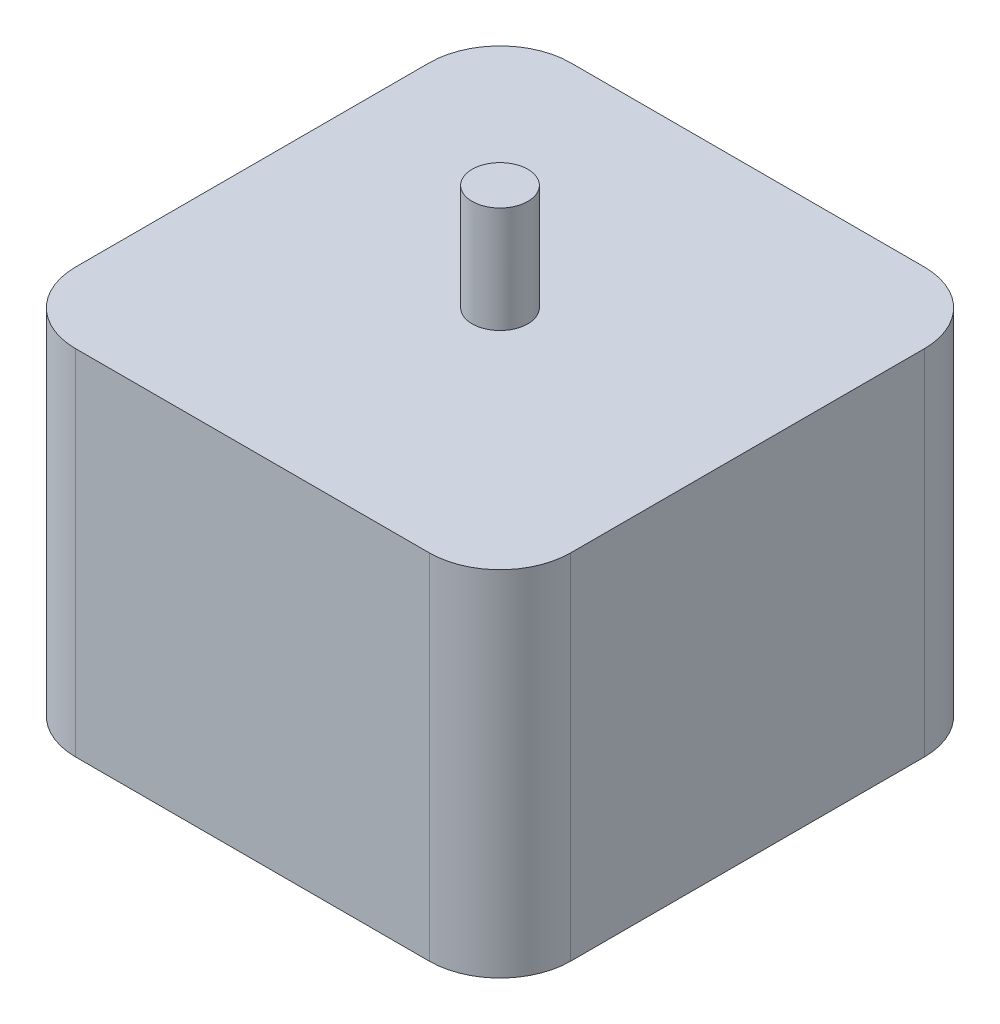
ISO-10303-21;
HEADER;
FILE_DESCRIPTION(('STEP AP214'),'2;1');
FILE_NAME('part.step','',(''),(''),'','','');
FILE_SCHEMA(('AUTOMOTIVE_DESIGN { 1 0 10303 214 1 1 1 1 }'));
ENDSEC;
DATA;
#1=APPLICATION_CONTEXT('core data for automotive mechanical design processes');
#2=APPLICATION_PROTOCOL_DEFINITION('international standard','automotive_design',2000,#1);
#3=PRODUCT_CONTEXT('',#1,'mechanical');
#4=PRODUCT('Part','Part','',(#3));
#5=PRODUCT_RELATED_PRODUCT_CATEGORY('part','',(#4));
#6=PRODUCT_DEFINITION_FORMATION('','',#4);
#7=PRODUCT_DEFINITION_CONTEXT('part definition',#1,'design');
#8=PRODUCT_DEFINITION('design','',#6,#7);
#9=PRODUCT_DEFINITION_SHAPE('','',#8);
#10=(LENGTH_UNIT() NAMED_UNIT(*) SI_UNIT(.MILLI.,.METRE.));
#11=(NAMED_UNIT(*) PLANE_ANGLE_UNIT() SI_UNIT($,.RADIAN.));
#12=(NAMED_UNIT(*) SI_UNIT($,.STERADIAN.) SOLID_ANGLE_UNIT());
#13=UNCERTAINTY_MEASURE_WITH_UNIT(LENGTH_MEASURE(1.E-05),#10,'distance_accuracy_value','');
#14=(GEOMETRIC_REPRESENTATION_CONTEXT(3) GLOBAL_UNCERTAINTY_ASSIGNED_CONTEXT((#13)) GLOBAL_UNIT_ASSIGNED_CONTEXT((#10,
#11,#12)) REPRESENTATION_CONTEXT('',''));
#15=CARTESIAN_POINT('',(0.,0.,0.));
#16=DIRECTION('',(0.,0.,1.));
#17=DIRECTION('',(1.,0.,0.));
#18=AXIS2_PLACEMENT_3D('',#15,#16,#17);
#19=CARTESIAN_POINT('',(22.225,31.75,22.225));
#20=DIRECTION('',(-1.,0.,0.));
#21=DIRECTION('',(0.,0.,1.));
#22=AXIS2_PLACEMENT_3D('',#19,#20,#21);
#23=PLANE('',#22);
#24=DIRECTION('',(0.,0.,-1.));
#25=VECTOR('',#24,1.);
#26=CARTESIAN_POINT('',(22.225,0.,22.225));
#27=LINE('',#26,#25);
#28=CARTESIAN_POINT('',(22.225,0.,15.875));
#29=VERTEX_POINT('',#28);
#30=CARTESIAN_POINT('',(22.225,0.,-15.875));
#31=VERTEX_POINT('',#30);
#32=EDGE_CURVE('E130',#29,#31,#27,.T.);
#33=ORIENTED_EDGE('',*,*,#32,.T.);
#34=DIRECTION('',(0.,-1.,0.));
#35=VECTOR('',#34,1.);
#36=CARTESIAN_POINT('',(22.225,31.75,-15.875));
#37=LINE('',#36,#35);
#38=CARTESIAN_POINT('',(22.225,31.75,-15.875));
#39=VERTEX_POINT('',#38);
#40=EDGE_CURVE('E41',#31,#39,#37,.F.);
#41=ORIENTED_EDGE('',*,*,#40,.T.);
#42=DIRECTION('',(0.,0.,-1.));
#43=VECTOR('',#42,1.);
#44=CARTESIAN_POINT('',(22.225,31.75,22.225));
#45=LINE('',#44,#43);
#46=CARTESIAN_POINT('',(22.225,31.75,15.875));
#47=VERTEX_POINT('',#46);
#48=EDGE_CURVE('E128',#47,#39,#45,.T.);
#49=ORIENTED_EDGE('',*,*,#48,.F.);
#50=DIRECTION('',(0.,-1.,0.));
#51=VECTOR('',#50,1.);
#52=CARTESIAN_POINT('',(22.225,31.75,15.875));
#53=LINE('',#52,#51);
#54=EDGE_CURVE('E154',#47,#29,#53,.T.);
#55=ORIENTED_EDGE('',*,*,#54,.T.);
#56=EDGE_LOOP('',(#33,#41,#49,#55));
#57=FACE_BOUND('',#56,.T.);
#58=ADVANCED_FACE('F33',(#57),#23,.F.);
#59=CARTESIAN_POINT('',(-22.225,31.75,-22.225));
#60=DIRECTION('',(0.,0.,1.));
#61=DIRECTION('',(1.,0.,0.));
#62=AXIS2_PLACEMENT_3D('',#59,#60,#61);
#63=PLANE('',#62);
#64=DIRECTION('',(-1.,0.,0.));
#65=VECTOR('',#64,1.);
#66=CARTESIAN_POINT('',(-22.225,0.,-22.225));
#67=LINE('',#66,#65);
#68=CARTESIAN_POINT('',(15.875,0.,-22.225));
#69=VERTEX_POINT('',#68);
#70=CARTESIAN_POINT('',(-15.875,0.,-22.225));
#71=VERTEX_POINT('',#70);
#72=EDGE_CURVE('E126',#69,#71,#67,.T.);
#73=ORIENTED_EDGE('',*,*,#72,.T.);
#74=DIRECTION('',(0.,-1.,0.));
#75=VECTOR('',#74,1.);
#76=CARTESIAN_POINT('',(-15.875,31.75,-22.225));
#77=LINE('',#76,#75);
#78=CARTESIAN_POINT('',(-15.875,31.75,-22.225));
#79=VERTEX_POINT('',#78);
#80=EDGE_CURVE('E105',#71,#79,#77,.F.);
#81=ORIENTED_EDGE('',*,*,#80,.T.);
#82=DIRECTION('',(-1.,0.,0.));
#83=VECTOR('',#82,1.);
#84=CARTESIAN_POINT('',(-22.225,31.75,-22.225));
#85=LINE('',#84,#83);
#86=CARTESIAN_POINT('',(15.875,31.75,-22.225));
#87=VERTEX_POINT('',#86);
#88=EDGE_CURVE('E169',#87,#79,#85,.T.);
#89=ORIENTED_EDGE('',*,*,#88,.F.);
#90=DIRECTION('',(0.,-1.,0.));
#91=VECTOR('',#90,1.);
#92=CARTESIAN_POINT('',(15.875,31.75,-22.225));
#93=LINE('',#92,#91);
#94=EDGE_CURVE('E110',#87,#69,#93,.T.);
#95=ORIENTED_EDGE('',*,*,#94,.T.);
#96=EDGE_LOOP('',(#73,#81,#89,#95));
#97=FACE_BOUND('',#96,.T.);
#98=ADVANCED_FACE('F174',(#97),#63,.F.);
#99=CARTESIAN_POINT('',(-22.225,31.75,22.225));
#100=DIRECTION('',(1.,0.,0.));
#101=DIRECTION('',(0.,0.,-1.));
#102=AXIS2_PLACEMENT_3D('',#99,#100,#101);
#103=PLANE('',#102);
#104=DIRECTION('',(0.,0.,1.));
#105=VECTOR('',#104,1.);
#106=CARTESIAN_POINT('',(-22.225,31.75,22.225));
#107=LINE('',#106,#105);
#108=CARTESIAN_POINT('',(-22.225,31.75,-15.875));
#109=VERTEX_POINT('',#108);
#110=CARTESIAN_POINT('',(-22.225,31.75,15.875));
#111=VERTEX_POINT('',#110);
#112=EDGE_CURVE('E119',#109,#111,#107,.T.);
#113=ORIENTED_EDGE('',*,*,#112,.F.);
#114=DIRECTION('',(0.,-1.,0.));
#115=VECTOR('',#114,1.);
#116=CARTESIAN_POINT('',(-22.225,31.75,-15.875));
#117=LINE('',#116,#115);
#118=CARTESIAN_POINT('',(-22.225,0.,-15.875));
#119=VERTEX_POINT('',#118);
#120=EDGE_CURVE('E104',#109,#119,#117,.T.);
#121=ORIENTED_EDGE('',*,*,#120,.T.);
#122=DIRECTION('',(0.,0.,1.));
#123=VECTOR('',#122,1.);
#124=CARTESIAN_POINT('',(-22.225,0.,22.225));
#125=LINE('',#124,#123);
#126=CARTESIAN_POINT('',(-22.225,0.,15.875));
#127=VERTEX_POINT('',#126);
#128=EDGE_CURVE('E117',#119,#127,#125,.T.);
#129=ORIENTED_EDGE('',*,*,#128,.T.);
#130=DIRECTION('',(0.,-1.,0.));
#131=VECTOR('',#130,1.);
#132=CARTESIAN_POINT('',(-22.225,31.75,15.875));
#133=LINE('',#132,#131);
#134=EDGE_CURVE('E121',#127,#111,#133,.F.);
#135=ORIENTED_EDGE('',*,*,#134,.T.);
#136=EDGE_LOOP('',(#113,#121,#129,#135));
#137=FACE_BOUND('',#136,.T.);
#138=ADVANCED_FACE('F116',(#137),#103,.F.);
#139=CARTESIAN_POINT('',(-22.225,31.75,22.225));
#140=DIRECTION('',(0.,0.,-1.));
#141=DIRECTION('',(-1.,0.,0.));
#142=AXIS2_PLACEMENT_3D('',#139,#140,#141);
#143=PLANE('',#142);
#144=DIRECTION('',(1.,0.,0.));
#145=VECTOR('',#144,1.);
#146=CARTESIAN_POINT('',(-22.225,31.75,22.225));
#147=LINE('',#146,#145);
#148=CARTESIAN_POINT('',(-15.875,31.75,22.225));
#149=VERTEX_POINT('',#148);
#150=CARTESIAN_POINT('',(15.875,31.75,22.225));
#151=VERTEX_POINT('',#150);
#152=EDGE_CURVE('E134',#149,#151,#147,.T.);
#153=ORIENTED_EDGE('',*,*,#152,.F.);
#154=DIRECTION('',(0.,-1.,0.));
#155=VECTOR('',#154,1.);
#156=CARTESIAN_POINT('',(-15.875,31.75,22.225));
#157=LINE('',#156,#155);
#158=CARTESIAN_POINT('',(-15.875,0.,22.225));
#159=VERTEX_POINT('',#158);
#160=EDGE_CURVE('E151',#149,#159,#157,.T.);
#161=ORIENTED_EDGE('',*,*,#160,.T.);
#162=DIRECTION('',(1.,0.,0.));
#163=VECTOR('',#162,1.);
#164=CARTESIAN_POINT('',(-22.225,0.,22.225));
#165=LINE('',#164,#163);
#166=CARTESIAN_POINT('',(15.875,0.,22.225));
#167=VERTEX_POINT('',#166);
#168=EDGE_CURVE('E125',#159,#167,#165,.T.);
#169=ORIENTED_EDGE('',*,*,#168,.T.);
#170=DIRECTION('',(0.,-1.,0.));
#171=VECTOR('',#170,1.);
#172=CARTESIAN_POINT('',(15.875,31.75,22.225));
#173=LINE('',#172,#171);
#174=EDGE_CURVE('E48',#167,#151,#173,.F.);
#175=ORIENTED_EDGE('',*,*,#174,.T.);
#176=EDGE_LOOP('',(#153,#161,#169,#175));
#177=FACE_BOUND('',#176,.T.);
#178=ADVANCED_FACE('F206',(#177),#143,.F.);
#179=CARTESIAN_POINT('',(0.,31.75,0.));
#180=DIRECTION('',(0.,-1.,0.));
#181=DIRECTION('',(0.,0.,-1.));
#182=AXIS2_PLACEMENT_3D('',#179,#180,#181);
#183=PLANE('',#182);
#184=CARTESIAN_POINT('',(0.,31.75,0.));
#185=DIRECTION('',(0.,-1.,0.));
#186=DIRECTION('',(0.,0.,-1.));
#187=AXIS2_PLACEMENT_3D('',#184,#185,#186);
#188=CIRCLE('',#187,2.5);
#189=CARTESIAN_POINT('',(0.,31.75,-2.5));
#190=VERTEX_POINT('',#189);
#191=EDGE_CURVE('E11',#190,#190,#188,.F.);
#192=ORIENTED_EDGE('',*,*,#191,.F.);
#193=EDGE_LOOP('',(#192));
#194=FACE_BOUND('',#193,.T.);
#195=ORIENTED_EDGE('',*,*,#88,.T.);
#196=CARTESIAN_POINT('',(-15.875,31.75,-15.875));
#197=DIRECTION('',(0.,-1.,0.));
#198=DIRECTION('',(0.,0.,-1.));
#199=AXIS2_PLACEMENT_3D('',#196,#197,#198);
#200=CIRCLE('',#199,6.35);
#201=EDGE_CURVE('E148',#79,#109,#200,.F.);
#202=ORIENTED_EDGE('',*,*,#201,.T.);
#203=ORIENTED_EDGE('',*,*,#112,.T.);
#204=CARTESIAN_POINT('',(-15.875,31.75,15.875));
#205=DIRECTION('',(0.,-1.,0.));
#206=DIRECTION('',(0.,0.,-1.));
#207=AXIS2_PLACEMENT_3D('',#204,#205,#206);
#208=CIRCLE('',#207,6.35);
#209=EDGE_CURVE('E55',#111,#149,#208,.F.);
#210=ORIENTED_EDGE('',*,*,#209,.T.);
#211=ORIENTED_EDGE('',*,*,#152,.T.);
#212=CARTESIAN_POINT('',(15.875,31.75,15.875));
#213=DIRECTION('',(0.,-1.,0.));
#214=DIRECTION('',(0.,0.,-1.));
#215=AXIS2_PLACEMENT_3D('',#212,#213,#214);
#216=CIRCLE('',#215,6.35);
#217=EDGE_CURVE('E143',#151,#47,#216,.F.);
#218=ORIENTED_EDGE('',*,*,#217,.T.);
#219=ORIENTED_EDGE('',*,*,#48,.T.);
#220=CARTESIAN_POINT('',(15.875,31.75,-15.875));
#221=DIRECTION('',(0.,-1.,0.));
#222=DIRECTION('',(0.,0.,-1.));
#223=AXIS2_PLACEMENT_3D('',#220,#221,#222);
#224=CIRCLE('',#223,6.35);
#225=EDGE_CURVE('E145',#39,#87,#224,.F.);
#226=ORIENTED_EDGE('',*,*,#225,.T.);
#227=EDGE_LOOP('',(#195,#202,#203,#210,#211,#218,#219,#226));
#228=FACE_BOUND('',#227,.T.);
#229=ADVANCED_FACE('F166',(#194,#228),#183,.F.);
#230=CARTESIAN_POINT('',(0.,0.,0.));
#231=DIRECTION('',(0.,-1.,0.));
#232=DIRECTION('',(0.,0.,-1.));
#233=AXIS2_PLACEMENT_3D('',#230,#231,#232);
#234=PLANE('',#233);
#235=CARTESIAN_POINT('',(0.,0.,0.));
#236=DIRECTION('',(0.,-1.,0.));
#237=DIRECTION('',(0.,0.,-1.));
#238=AXIS2_PLACEMENT_3D('',#235,#236,#237);
#239=CIRCLE('',#238,2.5);
#240=CARTESIAN_POINT('',(0.,0.,-2.5));
#241=VERTEX_POINT('',#240);
#242=EDGE_CURVE('E183',#241,#241,#239,.T.);
#243=ORIENTED_EDGE('',*,*,#242,.F.);
#244=EDGE_LOOP('',(#243));
#245=FACE_BOUND('',#244,.T.);
#246=ORIENTED_EDGE('',*,*,#128,.F.);
#247=CARTESIAN_POINT('',(-15.875,0.,-15.875));
#248=DIRECTION('',(0.,-1.,0.));
#249=DIRECTION('',(0.,0.,-1.));
#250=AXIS2_PLACEMENT_3D('',#247,#248,#249);
#251=CIRCLE('',#250,6.35);
#252=EDGE_CURVE('E100',#119,#71,#251,.T.);
#253=ORIENTED_EDGE('',*,*,#252,.T.);
#254=ORIENTED_EDGE('',*,*,#72,.F.);
#255=CARTESIAN_POINT('',(15.875,0.,-15.875));
#256=DIRECTION('',(0.,-1.,0.));
#257=DIRECTION('',(0.,0.,-1.));
#258=AXIS2_PLACEMENT_3D('',#255,#256,#257);
#259=CIRCLE('',#258,6.35);
#260=EDGE_CURVE('E137',#69,#31,#259,.T.);
#261=ORIENTED_EDGE('',*,*,#260,.T.);
#262=ORIENTED_EDGE('',*,*,#32,.F.);
#263=CARTESIAN_POINT('',(15.875,0.,15.875));
#264=DIRECTION('',(0.,-1.,0.));
#265=DIRECTION('',(0.,0.,-1.));
#266=AXIS2_PLACEMENT_3D('',#263,#264,#265);
#267=CIRCLE('',#266,6.35);
#268=EDGE_CURVE('E120',#29,#167,#267,.T.);
#269=ORIENTED_EDGE('',*,*,#268,.T.);
#270=ORIENTED_EDGE('',*,*,#168,.F.);
#271=CARTESIAN_POINT('',(-15.875,0.,15.875));
#272=DIRECTION('',(0.,-1.,0.));
#273=DIRECTION('',(0.,0.,-1.));
#274=AXIS2_PLACEMENT_3D('',#271,#272,#273);
#275=CIRCLE('',#274,6.35);
#276=EDGE_CURVE('E111',#159,#127,#275,.T.);
#277=ORIENTED_EDGE('',*,*,#276,.T.);
#278=EDGE_LOOP('',(#246,#253,#254,#261,#262,#269,#270,#277));
#279=FACE_BOUND('',#278,.T.);
#280=ADVANCED_FACE('F123',(#245,#279),#234,.T.);
#281=CARTESIAN_POINT('',(-15.875,31.75,-15.875));
#282=DIRECTION('',(0.,-1.,0.));
#283=DIRECTION('',(0.,0.,-1.));
#284=AXIS2_PLACEMENT_3D('',#281,#282,#283);
#285=CYLINDRICAL_SURFACE('',#284,6.35);
#286=ORIENTED_EDGE('',*,*,#201,.F.);
#287=ORIENTED_EDGE('',*,*,#80,.F.);
#288=ORIENTED_EDGE('',*,*,#252,.F.);
#289=ORIENTED_EDGE('',*,*,#120,.F.);
#290=EDGE_LOOP('',(#286,#287,#288,#289));
#291=FACE_BOUND('',#290,.T.);
#292=ADVANCED_FACE('F103',(#291),#285,.T.);
#293=CARTESIAN_POINT('',(-15.875,31.75,15.875));
#294=DIRECTION('',(0.,-1.,0.));
#295=DIRECTION('',(0.,0.,-1.));
#296=AXIS2_PLACEMENT_3D('',#293,#294,#295);
#297=CYLINDRICAL_SURFACE('',#296,6.35);
#298=ORIENTED_EDGE('',*,*,#209,.F.);
#299=ORIENTED_EDGE('',*,*,#134,.F.);
#300=ORIENTED_EDGE('',*,*,#276,.F.);
#301=ORIENTED_EDGE('',*,*,#160,.F.);
#302=EDGE_LOOP('',(#298,#299,#300,#301));
#303=FACE_BOUND('',#302,.T.);
#304=ADVANCED_FACE('F204',(#303),#297,.T.);
#305=CARTESIAN_POINT('',(15.875,31.75,-15.875));
#306=DIRECTION('',(0.,-1.,0.));
#307=DIRECTION('',(0.,0.,-1.));
#308=AXIS2_PLACEMENT_3D('',#305,#306,#307);
#309=CYLINDRICAL_SURFACE('',#308,6.35);
#310=ORIENTED_EDGE('',*,*,#225,.F.);
#311=ORIENTED_EDGE('',*,*,#40,.F.);
#312=ORIENTED_EDGE('',*,*,#260,.F.);
#313=ORIENTED_EDGE('',*,*,#94,.F.);
#314=EDGE_LOOP('',(#310,#311,#312,#313));
#315=FACE_BOUND('',#314,.T.);
#316=ADVANCED_FACE('F172',(#315),#309,.T.);
#317=CARTESIAN_POINT('',(15.875,31.75,15.875));
#318=DIRECTION('',(0.,-1.,0.));
#319=DIRECTION('',(0.,0.,-1.));
#320=AXIS2_PLACEMENT_3D('',#317,#318,#319);
#321=CYLINDRICAL_SURFACE('',#320,6.35);
#322=ORIENTED_EDGE('',*,*,#217,.F.);
#323=ORIENTED_EDGE('',*,*,#174,.F.);
#324=ORIENTED_EDGE('',*,*,#268,.F.);
#325=ORIENTED_EDGE('',*,*,#54,.F.);
#326=EDGE_LOOP('',(#322,#323,#324,#325));
#327=FACE_BOUND('',#326,.T.);
#328=ADVANCED_FACE('F35',(#327),#321,.T.);
#329=CARTESIAN_POINT('',(0.,41.275,0.));
#330=DIRECTION('',(0.,-1.,0.));
#331=DIRECTION('',(0.,0.,-1.));
#332=AXIS2_PLACEMENT_3D('',#329,#330,#331);
#333=CYLINDRICAL_SURFACE('',#332,2.5);
#334=CARTESIAN_POINT('',(0.,41.275,0.));
#335=DIRECTION('',(0.,1.,0.));
#336=DIRECTION('',(0.,0.,1.));
#337=AXIS2_PLACEMENT_3D('',#334,#335,#336);
#338=CIRCLE('',#337,2.5);
#339=CARTESIAN_POINT('',(0.,41.275,2.5));
#340=VERTEX_POINT('',#339);
#341=EDGE_CURVE('E175',#340,#340,#338,.T.);
#342=ORIENTED_EDGE('',*,*,#341,.F.);
#343=EDGE_LOOP('',(#342));
#344=FACE_BOUND('',#343,.T.);
#345=ORIENTED_EDGE('',*,*,#191,.T.);
#346=EDGE_LOOP('',(#345));
#347=FACE_BOUND('',#346,.T.);
#348=ADVANCED_FACE('F224',(#344,#347),#333,.T.);
#349=CARTESIAN_POINT('',(0.,41.275,0.));
#350=DIRECTION('',(0.,1.,0.));
#351=DIRECTION('',(0.,0.,1.));
#352=AXIS2_PLACEMENT_3D('',#349,#350,#351);
#353=PLANE('',#352);
#354=ORIENTED_EDGE('',*,*,#341,.T.);
#355=EDGE_LOOP('',(#354));
#356=FACE_BOUND('',#355,.T.);
#357=ADVANCED_FACE('F194',(#356),#353,.T.);
#358=CARTESIAN_POINT('',(0.,-9.525,0.));
#359=DIRECTION('',(0.,1.,0.));
#360=DIRECTION('',(0.,0.,1.));
#361=AXIS2_PLACEMENT_3D('',#358,#359,#360);
#362=CYLINDRICAL_SURFACE('',#361,2.5);
#363=CARTESIAN_POINT('',(0.,-9.525,0.));
#364=DIRECTION('',(0.,-1.,0.));
#365=DIRECTION('',(0.,0.,-1.));
#366=AXIS2_PLACEMENT_3D('',#363,#364,#365);
#367=CIRCLE('',#366,2.5);
#368=CARTESIAN_POINT('',(0.,-9.525,-2.5));
#369=VERTEX_POINT('',#368);
#370=EDGE_CURVE('E177',#369,#369,#367,.T.);
#371=ORIENTED_EDGE('',*,*,#370,.F.);
#372=EDGE_LOOP('',(#371));
#373=FACE_BOUND('',#372,.T.);
#374=ORIENTED_EDGE('',*,*,#242,.T.);
#375=EDGE_LOOP('',(#374));
#376=FACE_BOUND('',#375,.T.);
#377=ADVANCED_FACE('F191',(#373,#376),#362,.T.);
#378=CARTESIAN_POINT('',(0.,-9.525,0.));
#379=DIRECTION('',(0.,-1.,0.));
#380=DIRECTION('',(0.,0.,-1.));
#381=AXIS2_PLACEMENT_3D('',#378,#379,#380);
#382=PLANE('',#381);
#383=ORIENTED_EDGE('',*,*,#370,.T.);
#384=EDGE_LOOP('',(#383));
#385=FACE_BOUND('',#384,.T.);
#386=ADVANCED_FACE('F189',(#385),#382,.T.);
#387=CLOSED_SHELL('',(#58,#98,#138,#178,#229,#280,#292,#304,#316,#328,#348,#357,#377,#386));
#388=MANIFOLD_SOLID_BREP('B2',#387);
#389=ADVANCED_BREP_SHAPE_REPRESENTATION('',(#18,#388),#14);
#390=SHAPE_DEFINITION_REPRESENTATION(#9,#389);
ENDSEC;
END-ISO-10303-21;
